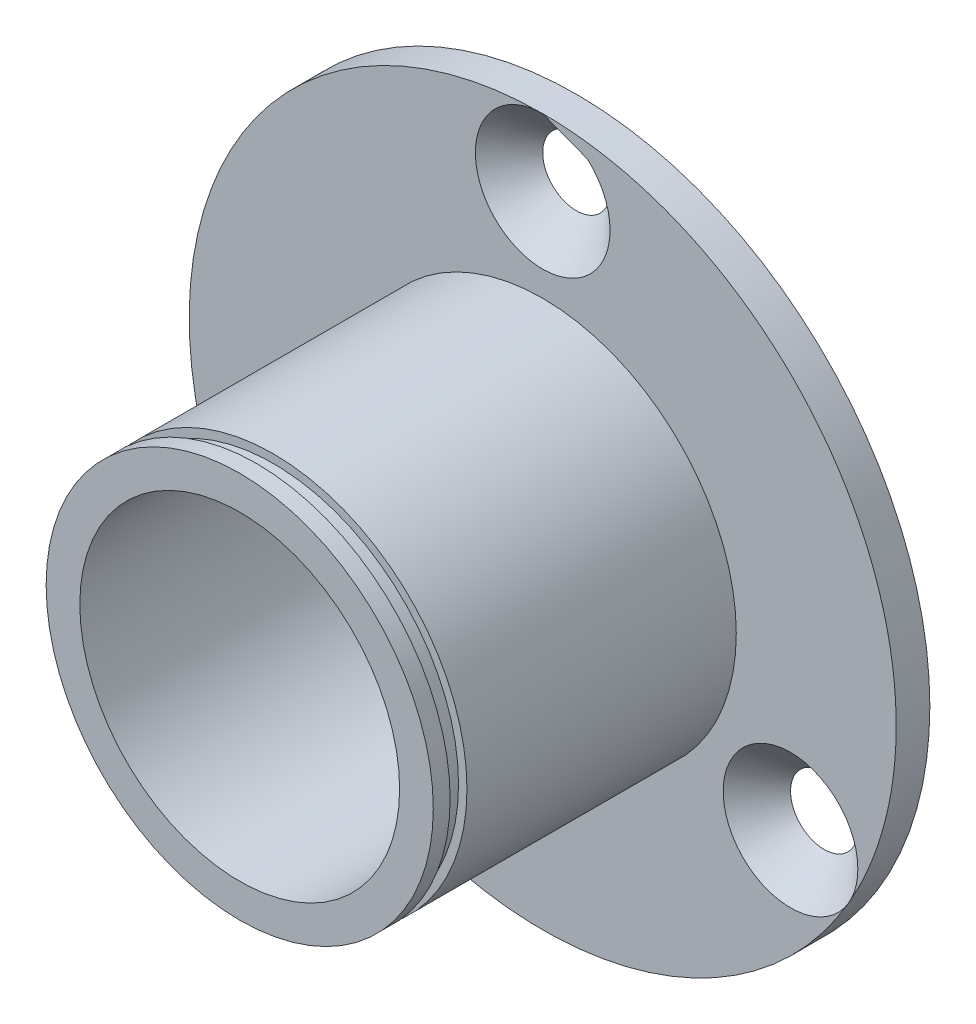
ISO-10303-21;
HEADER;
FILE_DESCRIPTION(('STEP AP214'),'2;1');
FILE_NAME('part.step','',(''),(''),'','','');
FILE_SCHEMA(('AUTOMOTIVE_DESIGN { 1 0 10303 214 1 1 1 1 }'));
ENDSEC;
DATA;
#1=APPLICATION_CONTEXT('core data for automotive mechanical design processes');
#2=APPLICATION_PROTOCOL_DEFINITION('international standard','automotive_design',2000,#1);
#3=PRODUCT_CONTEXT('',#1,'mechanical');
#4=PRODUCT('Part','Part','',(#3));
#5=PRODUCT_RELATED_PRODUCT_CATEGORY('part','',(#4));
#6=PRODUCT_DEFINITION_FORMATION('','',#4);
#7=PRODUCT_DEFINITION_CONTEXT('part definition',#1,'design');
#8=PRODUCT_DEFINITION('design','',#6,#7);
#9=PRODUCT_DEFINITION_SHAPE('','',#8);
#10=(LENGTH_UNIT() NAMED_UNIT(*) SI_UNIT(.MILLI.,.METRE.));
#11=(NAMED_UNIT(*) PLANE_ANGLE_UNIT() SI_UNIT($,.RADIAN.));
#12=(NAMED_UNIT(*) SI_UNIT($,.STERADIAN.) SOLID_ANGLE_UNIT());
#13=UNCERTAINTY_MEASURE_WITH_UNIT(LENGTH_MEASURE(1.E-05),#10,'distance_accuracy_value','');
#14=(GEOMETRIC_REPRESENTATION_CONTEXT(3) GLOBAL_UNCERTAINTY_ASSIGNED_CONTEXT((#13)) GLOBAL_UNIT_ASSIGNED_CONTEXT((#10,
#11,#12)) REPRESENTATION_CONTEXT('',''));
#15=CARTESIAN_POINT('',(0.,0.,0.));
#16=DIRECTION('',(0.,0.,1.));
#17=DIRECTION('',(1.,0.,0.));
#18=AXIS2_PLACEMENT_3D('',#15,#16,#17);
#19=CARTESIAN_POINT('',(0.,0.,78.5269119345812));
#20=DIRECTION('',(0.,0.,-1.));
#21=DIRECTION('',(-1.,0.,0.));
#22=AXIS2_PLACEMENT_3D('',#19,#20,#21);
#23=CYLINDRICAL_SURFACE('',#22,11.5);
#24=CARTESIAN_POINT('',(0.,0.,24.));
#25=DIRECTION('',(0.,0.,1.));
#26=DIRECTION('',(1.,0.,0.));
#27=AXIS2_PLACEMENT_3D('',#24,#25,#26);
#28=CIRCLE('',#27,11.5);
#29=CARTESIAN_POINT('',(11.5,0.,24.));
#30=VERTEX_POINT('',#29);
#31=EDGE_CURVE('E91',#30,#30,#28,.T.);
#32=ORIENTED_EDGE('',*,*,#31,.T.);
#33=EDGE_LOOP('',(#32));
#34=FACE_BOUND('',#33,.T.);
#35=CARTESIAN_POINT('',(0.,0.,40.));
#36=DIRECTION('',(0.,0.,1.));
#37=DIRECTION('',(1.,0.,0.));
#38=AXIS2_PLACEMENT_3D('',#35,#36,#37);
#39=CIRCLE('',#38,11.5);
#40=CARTESIAN_POINT('',(11.5,0.,40.));
#41=VERTEX_POINT('',#40);
#42=EDGE_CURVE('E97',#41,#41,#39,.T.);
#43=ORIENTED_EDGE('',*,*,#42,.F.);
#44=EDGE_LOOP('',(#43));
#45=FACE_BOUND('',#44,.T.);
#46=ADVANCED_FACE('F41',(#34,#45),#23,.T.);
#47=CARTESIAN_POINT('',(0.,0.,24.));
#48=DIRECTION('',(0.,0.,1.));
#49=DIRECTION('',(1.,0.,0.));
#50=AXIS2_PLACEMENT_3D('',#47,#48,#49);
#51=PLANE('',#50);
#52=CARTESIAN_POINT('',(0.,0.,24.));
#53=DIRECTION('',(0.,0.,1.));
#54=DIRECTION('',(1.,0.,0.));
#55=AXIS2_PLACEMENT_3D('',#52,#53,#54);
#56=CIRCLE('',#55,21.);
#57=CARTESIAN_POINT('',(0.,21.,24.));
#58=VERTEX_POINT('',#57);
#59=CARTESIAN_POINT('',(-18.1865334794732,-10.5,24.));
#60=VERTEX_POINT('',#59);
#61=EDGE_CURVE('E66',#58,#60,#56,.T.);
#62=ORIENTED_EDGE('',*,*,#61,.T.);
#63=CARTESIAN_POINT('',(-14.7224318643355,-8.50000000000001,24.));
#64=DIRECTION('',(0.,0.,1.));
#65=DIRECTION('',(1.,0.,0.));
#66=AXIS2_PLACEMENT_3D('',#63,#64,#65);
#67=CIRCLE('',#66,4.00000000000002);
#68=EDGE_CURVE('E11',#60,#60,#67,.F.);
#69=ORIENTED_EDGE('',*,*,#68,.T.);
#70=CARTESIAN_POINT('',(18.1865334794732,-10.5,24.));
#71=VERTEX_POINT('',#70);
#72=EDGE_CURVE('E68',#60,#71,#56,.T.);
#73=ORIENTED_EDGE('',*,*,#72,.T.);
#74=CARTESIAN_POINT('',(14.7224318643355,-8.5,24.));
#75=DIRECTION('',(0.,0.,1.));
#76=DIRECTION('',(1.,0.,0.));
#77=AXIS2_PLACEMENT_3D('',#74,#75,#76);
#78=CIRCLE('',#77,4.00000000000002);
#79=EDGE_CURVE('E49',#71,#71,#78,.F.);
#80=ORIENTED_EDGE('',*,*,#79,.T.);
#81=EDGE_CURVE('E70',#71,#58,#56,.T.);
#82=ORIENTED_EDGE('',*,*,#81,.T.);
#83=CARTESIAN_POINT('',(0.,17.,24.));
#84=DIRECTION('',(0.,0.,1.));
#85=DIRECTION('',(1.,0.,0.));
#86=AXIS2_PLACEMENT_3D('',#83,#84,#85);
#87=CIRCLE('',#86,4.00000000000002);
#88=EDGE_CURVE('E61',#58,#58,#87,.F.);
#89=ORIENTED_EDGE('',*,*,#88,.T.);
#90=EDGE_LOOP('',(#62,#69,#73,#80,#82,#89));
#91=FACE_BOUND('',#90,.T.);
#92=ORIENTED_EDGE('',*,*,#31,.F.);
#93=EDGE_LOOP('',(#92));
#94=FACE_BOUND('',#93,.T.);
#95=ADVANCED_FACE('F130',(#91,#94),#51,.T.);
#96=CARTESIAN_POINT('',(0.,0.,22.));
#97=DIRECTION('',(0.,0.,1.));
#98=DIRECTION('',(1.,0.,0.));
#99=AXIS2_PLACEMENT_3D('',#96,#97,#98);
#100=PLANE('',#99);
#101=CARTESIAN_POINT('',(0.,0.,22.));
#102=DIRECTION('',(0.,0.,1.));
#103=DIRECTION('',(1.,0.,0.));
#104=AXIS2_PLACEMENT_3D('',#101,#102,#103);
#105=CIRCLE('',#104,21.);
#106=CARTESIAN_POINT('',(21.,0.,22.));
#107=VERTEX_POINT('',#106);
#108=EDGE_CURVE('E72',#107,#107,#105,.T.);
#109=ORIENTED_EDGE('',*,*,#108,.F.);
#110=EDGE_LOOP('',(#109));
#111=FACE_BOUND('',#110,.T.);
#112=CARTESIAN_POINT('',(0.,0.,22.));
#113=DIRECTION('',(0.,0.,1.));
#114=DIRECTION('',(1.,0.,0.));
#115=AXIS2_PLACEMENT_3D('',#112,#113,#114);
#116=CIRCLE('',#115,9.5);
#117=CARTESIAN_POINT('',(9.50000000000001,0.,22.));
#118=VERTEX_POINT('',#117);
#119=EDGE_CURVE('E74',#118,#118,#116,.T.);
#120=ORIENTED_EDGE('',*,*,#119,.T.);
#121=EDGE_LOOP('',(#120));
#122=FACE_BOUND('',#121,.T.);
#123=CARTESIAN_POINT('',(-14.7224318643355,-8.50000000000001,22.));
#124=DIRECTION('',(0.,0.,1.));
#125=DIRECTION('',(1.,0.,0.));
#126=AXIS2_PLACEMENT_3D('',#123,#124,#125);
#127=CIRCLE('',#126,2.);
#128=CARTESIAN_POINT('',(-12.7224318643355,-8.50000000000001,22.));
#129=VERTEX_POINT('',#128);
#130=EDGE_CURVE('E78',#129,#129,#127,.T.);
#131=ORIENTED_EDGE('',*,*,#130,.T.);
#132=EDGE_LOOP('',(#131));
#133=FACE_BOUND('',#132,.T.);
#134=CARTESIAN_POINT('',(14.7224318643355,-8.5,22.));
#135=DIRECTION('',(0.,0.,1.));
#136=DIRECTION('',(1.,0.,0.));
#137=AXIS2_PLACEMENT_3D('',#134,#135,#136);
#138=CIRCLE('',#137,2.);
#139=CARTESIAN_POINT('',(16.7224318643355,-8.5,22.));
#140=VERTEX_POINT('',#139);
#141=EDGE_CURVE('E81',#140,#140,#138,.T.);
#142=ORIENTED_EDGE('',*,*,#141,.T.);
#143=EDGE_LOOP('',(#142));
#144=FACE_BOUND('',#143,.T.);
#145=CARTESIAN_POINT('',(0.,17.,22.));
#146=DIRECTION('',(0.,0.,1.));
#147=DIRECTION('',(1.,0.,0.));
#148=AXIS2_PLACEMENT_3D('',#145,#146,#147);
#149=CIRCLE('',#148,2.);
#150=CARTESIAN_POINT('',(2.,17.,22.));
#151=VERTEX_POINT('',#150);
#152=EDGE_CURVE('E84',#151,#151,#149,.T.);
#153=ORIENTED_EDGE('',*,*,#152,.T.);
#154=EDGE_LOOP('',(#153));
#155=FACE_BOUND('',#154,.T.);
#156=ADVANCED_FACE('F138',(#111,#122,#133,#144,#155),#100,.F.);
#157=CARTESIAN_POINT('',(0.,0.,24.));
#158=DIRECTION('',(0.,0.,-1.));
#159=DIRECTION('',(-1.,0.,0.));
#160=AXIS2_PLACEMENT_3D('',#157,#158,#159);
#161=CYLINDRICAL_SURFACE('',#160,21.);
#162=ORIENTED_EDGE('',*,*,#61,.F.);
#163=ORIENTED_EDGE('',*,*,#81,.F.);
#164=ORIENTED_EDGE('',*,*,#72,.F.);
#165=EDGE_LOOP('',(#162,#163,#164));
#166=FACE_BOUND('',#165,.T.);
#167=ORIENTED_EDGE('',*,*,#108,.T.);
#168=EDGE_LOOP('',(#167));
#169=FACE_BOUND('',#168,.T.);
#170=ADVANCED_FACE('F168',(#166,#169),#161,.T.);
#171=CARTESIAN_POINT('',(0.,0.,24.));
#172=DIRECTION('',(0.,0.,-1.));
#173=DIRECTION('',(-1.,0.,0.));
#174=AXIS2_PLACEMENT_3D('',#171,#172,#173);
#175=CYLINDRICAL_SURFACE('',#174,9.5);
#176=ORIENTED_EDGE('',*,*,#119,.F.);
#177=EDGE_LOOP('',(#176));
#178=FACE_BOUND('',#177,.T.);
#179=CARTESIAN_POINT('',(0.,0.,42.));
#180=DIRECTION('',(0.,0.,1.));
#181=DIRECTION('',(1.,0.,0.));
#182=AXIS2_PLACEMENT_3D('',#179,#180,#181);
#183=CIRCLE('',#182,9.5);
#184=CARTESIAN_POINT('',(9.50000000000001,0.,42.));
#185=VERTEX_POINT('',#184);
#186=EDGE_CURVE('E88',#185,#185,#183,.T.);
#187=ORIENTED_EDGE('',*,*,#186,.T.);
#188=EDGE_LOOP('',(#187));
#189=FACE_BOUND('',#188,.T.);
#190=ADVANCED_FACE('F164',(#178,#189),#175,.F.);
#191=CARTESIAN_POINT('',(-14.7224318643355,-8.50000000000001,22.));
#192=DIRECTION('',(0.,0.,1.));
#193=DIRECTION('',(1.,0.,0.));
#194=AXIS2_PLACEMENT_3D('',#191,#192,#193);
#195=CONICAL_SURFACE('',#194,2.,0.785398163397451);
#196=ORIENTED_EDGE('',*,*,#68,.F.);
#197=EDGE_LOOP('',(#196));
#198=FACE_BOUND('',#197,.T.);
#199=ORIENTED_EDGE('',*,*,#130,.F.);
#200=EDGE_LOOP('',(#199));
#201=FACE_BOUND('',#200,.T.);
#202=ADVANCED_FACE('F159',(#198,#201),#195,.F.);
#203=CARTESIAN_POINT('',(14.7224318643355,-8.5,22.));
#204=DIRECTION('',(0.,0.,1.));
#205=DIRECTION('',(1.,0.,0.));
#206=AXIS2_PLACEMENT_3D('',#203,#204,#205);
#207=CONICAL_SURFACE('',#206,2.,0.78539816339745);
#208=ORIENTED_EDGE('',*,*,#79,.F.);
#209=EDGE_LOOP('',(#208));
#210=FACE_BOUND('',#209,.T.);
#211=ORIENTED_EDGE('',*,*,#141,.F.);
#212=EDGE_LOOP('',(#211));
#213=FACE_BOUND('',#212,.T.);
#214=ADVANCED_FACE('F150',(#210,#213),#207,.F.);
#215=CARTESIAN_POINT('',(0.,17.,22.));
#216=DIRECTION('',(0.,0.,1.));
#217=DIRECTION('',(1.,0.,0.));
#218=AXIS2_PLACEMENT_3D('',#215,#216,#217);
#219=CONICAL_SURFACE('',#218,2.,0.78539816339745);
#220=ORIENTED_EDGE('',*,*,#88,.F.);
#221=EDGE_LOOP('',(#220));
#222=FACE_BOUND('',#221,.T.);
#223=ORIENTED_EDGE('',*,*,#152,.F.);
#224=EDGE_LOOP('',(#223));
#225=FACE_BOUND('',#224,.T.);
#226=ADVANCED_FACE('F43',(#222,#225),#219,.F.);
#227=CARTESIAN_POINT('',(0.,0.,41.));
#228=DIRECTION('',(0.,0.,1.));
#229=DIRECTION('',(1.,0.,0.));
#230=AXIS2_PLACEMENT_3D('',#227,#228,#229);
#231=CIRCLE('',#230,11.5);
#232=CARTESIAN_POINT('',(11.5,0.,41.));
#233=VERTEX_POINT('',#232);
#234=EDGE_CURVE('E92',#233,#233,#231,.T.);
#235=ORIENTED_EDGE('',*,*,#234,.T.);
#236=EDGE_LOOP('',(#235));
#237=FACE_BOUND('',#236,.T.);
#238=CARTESIAN_POINT('',(0.,0.,42.));
#239=DIRECTION('',(0.,0.,1.));
#240=DIRECTION('',(1.,0.,0.));
#241=AXIS2_PLACEMENT_3D('',#238,#239,#240);
#242=CIRCLE('',#241,11.5);
#243=CARTESIAN_POINT('',(11.5,0.,42.));
#244=VERTEX_POINT('',#243);
#245=EDGE_CURVE('E87',#244,#244,#242,.T.);
#246=ORIENTED_EDGE('',*,*,#245,.F.);
#247=EDGE_LOOP('',(#246));
#248=FACE_BOUND('',#247,.T.);
#249=ADVANCED_FACE('F133',(#237,#248),#23,.T.);
#250=CARTESIAN_POINT('',(0.,0.,42.));
#251=DIRECTION('',(0.,0.,1.));
#252=DIRECTION('',(1.,0.,0.));
#253=AXIS2_PLACEMENT_3D('',#250,#251,#252);
#254=PLANE('',#253);
#255=ORIENTED_EDGE('',*,*,#186,.F.);
#256=EDGE_LOOP('',(#255));
#257=FACE_BOUND('',#256,.T.);
#258=ORIENTED_EDGE('',*,*,#245,.T.);
#259=EDGE_LOOP('',(#258));
#260=FACE_BOUND('',#259,.T.);
#261=ADVANCED_FACE('F125',(#257,#260),#254,.T.);
#262=CARTESIAN_POINT('',(0.,0.,41.));
#263=DIRECTION('',(0.,0.,1.));
#264=DIRECTION('',(1.,0.,0.));
#265=AXIS2_PLACEMENT_3D('',#262,#263,#264);
#266=PLANE('',#265);
#267=ORIENTED_EDGE('',*,*,#234,.F.);
#268=EDGE_LOOP('',(#267));
#269=FACE_BOUND('',#268,.T.);
#270=CARTESIAN_POINT('',(0.,0.,41.));
#271=DIRECTION('',(0.,0.,1.));
#272=DIRECTION('',(1.,0.,0.));
#273=AXIS2_PLACEMENT_3D('',#270,#271,#272);
#274=CIRCLE('',#273,11.);
#275=CARTESIAN_POINT('',(11.,0.,41.));
#276=VERTEX_POINT('',#275);
#277=EDGE_CURVE('E100',#276,#276,#274,.T.);
#278=ORIENTED_EDGE('',*,*,#277,.T.);
#279=EDGE_LOOP('',(#278));
#280=FACE_BOUND('',#279,.T.);
#281=ADVANCED_FACE('F109',(#269,#280),#266,.F.);
#282=CARTESIAN_POINT('',(0.,0.,40.));
#283=DIRECTION('',(0.,0.,1.));
#284=DIRECTION('',(1.,0.,0.));
#285=AXIS2_PLACEMENT_3D('',#282,#283,#284);
#286=PLANE('',#285);
#287=ORIENTED_EDGE('',*,*,#42,.T.);
#288=EDGE_LOOP('',(#287));
#289=FACE_BOUND('',#288,.T.);
#290=CARTESIAN_POINT('',(0.,0.,40.));
#291=DIRECTION('',(0.,0.,1.));
#292=DIRECTION('',(1.,0.,0.));
#293=AXIS2_PLACEMENT_3D('',#290,#291,#292);
#294=CIRCLE('',#293,11.);
#295=CARTESIAN_POINT('',(11.,0.,40.));
#296=VERTEX_POINT('',#295);
#297=EDGE_CURVE('E103',#296,#296,#294,.T.);
#298=ORIENTED_EDGE('',*,*,#297,.F.);
#299=EDGE_LOOP('',(#298));
#300=FACE_BOUND('',#299,.T.);
#301=ADVANCED_FACE('F114',(#289,#300),#286,.T.);
#302=CARTESIAN_POINT('',(0.,0.,41.));
#303=DIRECTION('',(0.,0.,-1.));
#304=DIRECTION('',(-1.,0.,0.));
#305=AXIS2_PLACEMENT_3D('',#302,#303,#304);
#306=CYLINDRICAL_SURFACE('',#305,11.);
#307=ORIENTED_EDGE('',*,*,#277,.F.);
#308=EDGE_LOOP('',(#307));
#309=FACE_BOUND('',#308,.T.);
#310=ORIENTED_EDGE('',*,*,#297,.T.);
#311=EDGE_LOOP('',(#310));
#312=FACE_BOUND('',#311,.T.);
#313=ADVANCED_FACE('F111',(#309,#312),#306,.T.);
#314=CLOSED_SHELL('',(#46,#95,#156,#170,#190,#202,#214,#226,#249,#261,#281,#301,#313));
#315=MANIFOLD_SOLID_BREP('B2',#314);
#316=ADVANCED_BREP_SHAPE_REPRESENTATION('',(#18,#315),#14);
#317=SHAPE_DEFINITION_REPRESENTATION(#9,#316);
ENDSEC;
END-ISO-10303-21;
